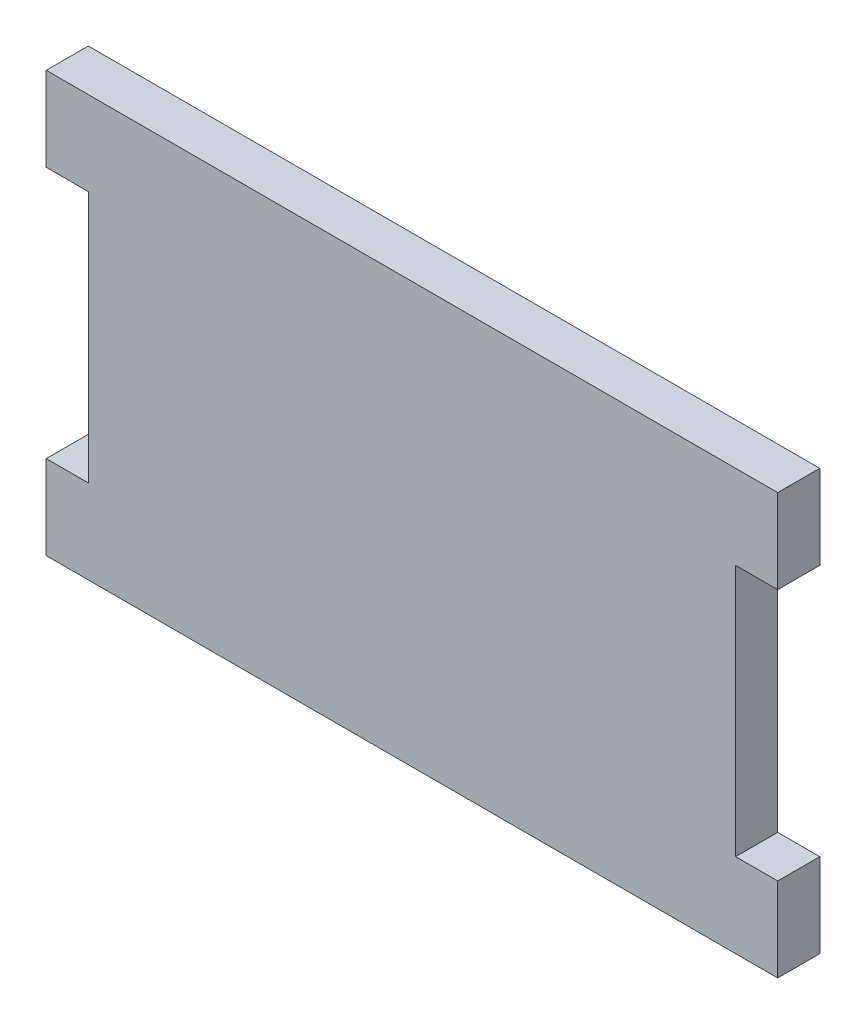
ISO-10303-21;
HEADER;
FILE_DESCRIPTION(('STEP AP214'),'2;1');
FILE_NAME('part.step','',(''),(''),'','','');
FILE_SCHEMA(('AUTOMOTIVE_DESIGN { 1 0 10303 214 1 1 1 1 }'));
ENDSEC;
DATA;
#1=APPLICATION_CONTEXT('core data for automotive mechanical design processes');
#2=APPLICATION_PROTOCOL_DEFINITION('international standard','automotive_design',2000,#1);
#3=PRODUCT_CONTEXT('',#1,'mechanical');
#4=PRODUCT('Part','Part','',(#3));
#5=PRODUCT_RELATED_PRODUCT_CATEGORY('part','',(#4));
#6=PRODUCT_DEFINITION_FORMATION('','',#4);
#7=PRODUCT_DEFINITION_CONTEXT('part definition',#1,'design');
#8=PRODUCT_DEFINITION('design','',#6,#7);
#9=PRODUCT_DEFINITION_SHAPE('','',#8);
#10=(LENGTH_UNIT() NAMED_UNIT(*) SI_UNIT(.MILLI.,.METRE.));
#11=(NAMED_UNIT(*) PLANE_ANGLE_UNIT() SI_UNIT($,.RADIAN.));
#12=(NAMED_UNIT(*) SI_UNIT($,.STERADIAN.) SOLID_ANGLE_UNIT());
#13=UNCERTAINTY_MEASURE_WITH_UNIT(LENGTH_MEASURE(1.E-05),#10,'distance_accuracy_value','');
#14=(GEOMETRIC_REPRESENTATION_CONTEXT(3) GLOBAL_UNCERTAINTY_ASSIGNED_CONTEXT((#13)) GLOBAL_UNIT_ASSIGNED_CONTEXT((#10,
#11,#12)) REPRESENTATION_CONTEXT('',''));
#15=CARTESIAN_POINT('',(0.,0.,0.));
#16=DIRECTION('',(0.,0.,1.));
#17=DIRECTION('',(1.,0.,0.));
#18=AXIS2_PLACEMENT_3D('',#15,#16,#17);
#19=CARTESIAN_POINT('',(-43.5,-25.,5.));
#20=DIRECTION('',(0.,1.,0.));
#21=DIRECTION('',(0.,0.,1.));
#22=AXIS2_PLACEMENT_3D('',#19,#20,#21);
#23=PLANE('',#22);
#24=DIRECTION('',(1.,0.,0.));
#25=VECTOR('',#24,1.);
#26=CARTESIAN_POINT('',(-43.5,-25.,0.));
#27=LINE('',#26,#25);
#28=CARTESIAN_POINT('',(-43.5,-25.,0.));
#29=VERTEX_POINT('',#28);
#30=CARTESIAN_POINT('',(43.5,-25.,0.));
#31=VERTEX_POINT('',#30);
#32=EDGE_CURVE('E153',#29,#31,#27,.T.);
#33=ORIENTED_EDGE('',*,*,#32,.T.);
#34=DIRECTION('',(0.,0.,-1.));
#35=VECTOR('',#34,1.);
#36=CARTESIAN_POINT('',(43.5,-25.,5.));
#37=LINE('',#36,#35);
#38=CARTESIAN_POINT('',(43.5,-25.,5.));
#39=VERTEX_POINT('',#38);
#40=EDGE_CURVE('E11',#39,#31,#37,.T.);
#41=ORIENTED_EDGE('',*,*,#40,.F.);
#42=DIRECTION('',(1.,0.,0.));
#43=VECTOR('',#42,1.);
#44=CARTESIAN_POINT('',(-43.5,-25.,5.));
#45=LINE('',#44,#43);
#46=CARTESIAN_POINT('',(-43.5,-25.,5.));
#47=VERTEX_POINT('',#46);
#48=EDGE_CURVE('E175',#47,#39,#45,.T.);
#49=ORIENTED_EDGE('',*,*,#48,.F.);
#50=DIRECTION('',(0.,0.,-1.));
#51=VECTOR('',#50,1.);
#52=CARTESIAN_POINT('',(-43.5,-25.,5.));
#53=LINE('',#52,#51);
#54=EDGE_CURVE('E149',#47,#29,#53,.T.);
#55=ORIENTED_EDGE('',*,*,#54,.T.);
#56=EDGE_LOOP('',(#33,#41,#49,#55));
#57=FACE_BOUND('',#56,.T.);
#58=ADVANCED_FACE('F33',(#57),#23,.F.);
#59=CARTESIAN_POINT('',(43.5,-15.,5.));
#60=DIRECTION('',(-1.,0.,0.));
#61=DIRECTION('',(0.,-1.,0.));
#62=AXIS2_PLACEMENT_3D('',#59,#60,#61);
#63=PLANE('',#62);
#64=DIRECTION('',(0.,1.,0.));
#65=VECTOR('',#64,1.);
#66=CARTESIAN_POINT('',(43.5,-15.,0.));
#67=LINE('',#66,#65);
#68=CARTESIAN_POINT('',(43.5,-15.,0.));
#69=VERTEX_POINT('',#68);
#70=EDGE_CURVE('E156',#31,#69,#67,.T.);
#71=ORIENTED_EDGE('',*,*,#70,.T.);
#72=DIRECTION('',(0.,0.,-1.));
#73=VECTOR('',#72,1.);
#74=CARTESIAN_POINT('',(43.5,-15.,5.));
#75=LINE('',#74,#73);
#76=CARTESIAN_POINT('',(43.5,-15.,5.));
#77=VERTEX_POINT('',#76);
#78=EDGE_CURVE('E41',#77,#69,#75,.T.);
#79=ORIENTED_EDGE('',*,*,#78,.F.);
#80=DIRECTION('',(0.,1.,0.));
#81=VECTOR('',#80,1.);
#82=CARTESIAN_POINT('',(43.5,-15.,5.));
#83=LINE('',#82,#81);
#84=EDGE_CURVE('E104',#39,#77,#83,.T.);
#85=ORIENTED_EDGE('',*,*,#84,.F.);
#86=ORIENTED_EDGE('',*,*,#40,.T.);
#87=EDGE_LOOP('',(#71,#79,#85,#86));
#88=FACE_BOUND('',#87,.T.);
#89=ADVANCED_FACE('F253',(#88),#63,.F.);
#90=CARTESIAN_POINT('',(43.5,-15.,5.));
#91=DIRECTION('',(0.,-1.,0.));
#92=DIRECTION('',(0.,0.,-1.));
#93=AXIS2_PLACEMENT_3D('',#90,#91,#92);
#94=PLANE('',#93);
#95=DIRECTION('',(-1.,0.,0.));
#96=VECTOR('',#95,1.);
#97=CARTESIAN_POINT('',(43.5,-15.,0.));
#98=LINE('',#97,#96);
#99=CARTESIAN_POINT('',(38.5,-15.,0.));
#100=VERTEX_POINT('',#99);
#101=EDGE_CURVE('E158',#69,#100,#98,.T.);
#102=ORIENTED_EDGE('',*,*,#101,.T.);
#103=DIRECTION('',(0.,0.,-1.));
#104=VECTOR('',#103,1.);
#105=CARTESIAN_POINT('',(38.5,-15.,5.));
#106=LINE('',#105,#104);
#107=CARTESIAN_POINT('',(38.5,-15.,5.));
#108=VERTEX_POINT('',#107);
#109=EDGE_CURVE('E194',#108,#100,#106,.T.);
#110=ORIENTED_EDGE('',*,*,#109,.F.);
#111=DIRECTION('',(-1.,0.,0.));
#112=VECTOR('',#111,1.);
#113=CARTESIAN_POINT('',(43.5,-15.,5.));
#114=LINE('',#113,#112);
#115=EDGE_CURVE('E202',#77,#108,#114,.T.);
#116=ORIENTED_EDGE('',*,*,#115,.F.);
#117=ORIENTED_EDGE('',*,*,#78,.T.);
#118=EDGE_LOOP('',(#102,#110,#116,#117));
#119=FACE_BOUND('',#118,.T.);
#120=ADVANCED_FACE('F200',(#119),#94,.F.);
#121=CARTESIAN_POINT('',(38.5,15.,5.));
#122=DIRECTION('',(-1.,0.,0.));
#123=DIRECTION('',(0.,-1.,0.));
#124=AXIS2_PLACEMENT_3D('',#121,#122,#123);
#125=PLANE('',#124);
#126=DIRECTION('',(0.,1.,0.));
#127=VECTOR('',#126,1.);
#128=CARTESIAN_POINT('',(38.5,15.,0.));
#129=LINE('',#128,#127);
#130=CARTESIAN_POINT('',(38.5,15.,0.));
#131=VERTEX_POINT('',#130);
#132=EDGE_CURVE('E160',#100,#131,#129,.T.);
#133=ORIENTED_EDGE('',*,*,#132,.T.);
#134=DIRECTION('',(0.,0.,-1.));
#135=VECTOR('',#134,1.);
#136=CARTESIAN_POINT('',(38.5,15.,5.));
#137=LINE('',#136,#135);
#138=CARTESIAN_POINT('',(38.5,15.,5.));
#139=VERTEX_POINT('',#138);
#140=EDGE_CURVE('E191',#139,#131,#137,.T.);
#141=ORIENTED_EDGE('',*,*,#140,.F.);
#142=DIRECTION('',(0.,1.,0.));
#143=VECTOR('',#142,1.);
#144=CARTESIAN_POINT('',(38.5,15.,5.));
#145=LINE('',#144,#143);
#146=EDGE_CURVE('E220',#108,#139,#145,.T.);
#147=ORIENTED_EDGE('',*,*,#146,.F.);
#148=ORIENTED_EDGE('',*,*,#109,.T.);
#149=EDGE_LOOP('',(#133,#141,#147,#148));
#150=FACE_BOUND('',#149,.T.);
#151=ADVANCED_FACE('F211',(#150),#125,.F.);
#152=CARTESIAN_POINT('',(43.5,15.,5.));
#153=DIRECTION('',(0.,1.,0.));
#154=DIRECTION('',(0.,0.,1.));
#155=AXIS2_PLACEMENT_3D('',#152,#153,#154);
#156=PLANE('',#155);
#157=DIRECTION('',(1.,0.,0.));
#158=VECTOR('',#157,1.);
#159=CARTESIAN_POINT('',(43.5,15.,0.));
#160=LINE('',#159,#158);
#161=CARTESIAN_POINT('',(43.5,15.,0.));
#162=VERTEX_POINT('',#161);
#163=EDGE_CURVE('E162',#131,#162,#160,.T.);
#164=ORIENTED_EDGE('',*,*,#163,.T.);
#165=DIRECTION('',(0.,0.,-1.));
#166=VECTOR('',#165,1.);
#167=CARTESIAN_POINT('',(43.5,15.,5.));
#168=LINE('',#167,#166);
#169=CARTESIAN_POINT('',(43.5,15.,5.));
#170=VERTEX_POINT('',#169);
#171=EDGE_CURVE('E188',#170,#162,#168,.T.);
#172=ORIENTED_EDGE('',*,*,#171,.F.);
#173=DIRECTION('',(1.,0.,0.));
#174=VECTOR('',#173,1.);
#175=CARTESIAN_POINT('',(43.5,15.,5.));
#176=LINE('',#175,#174);
#177=EDGE_CURVE('E217',#139,#170,#176,.T.);
#178=ORIENTED_EDGE('',*,*,#177,.F.);
#179=ORIENTED_EDGE('',*,*,#140,.T.);
#180=EDGE_LOOP('',(#164,#172,#178,#179));
#181=FACE_BOUND('',#180,.T.);
#182=ADVANCED_FACE('F215',(#181),#156,.F.);
#183=CARTESIAN_POINT('',(43.5,25.,5.));
#184=DIRECTION('',(-1.,0.,0.));
#185=DIRECTION('',(0.,0.,1.));
#186=AXIS2_PLACEMENT_3D('',#183,#184,#185);
#187=PLANE('',#186);
#188=DIRECTION('',(0.,1.,0.));
#189=VECTOR('',#188,1.);
#190=CARTESIAN_POINT('',(43.5,25.,0.));
#191=LINE('',#190,#189);
#192=CARTESIAN_POINT('',(43.5,25.,0.));
#193=VERTEX_POINT('',#192);
#194=EDGE_CURVE('E164',#162,#193,#191,.T.);
#195=ORIENTED_EDGE('',*,*,#194,.T.);
#196=DIRECTION('',(0.,0.,-1.));
#197=VECTOR('',#196,1.);
#198=CARTESIAN_POINT('',(43.5,25.,5.));
#199=LINE('',#198,#197);
#200=CARTESIAN_POINT('',(43.5,25.,5.));
#201=VERTEX_POINT('',#200);
#202=EDGE_CURVE('E185',#201,#193,#199,.T.);
#203=ORIENTED_EDGE('',*,*,#202,.F.);
#204=DIRECTION('',(0.,1.,0.));
#205=VECTOR('',#204,1.);
#206=CARTESIAN_POINT('',(43.5,25.,5.));
#207=LINE('',#206,#205);
#208=EDGE_CURVE('E219',#170,#201,#207,.T.);
#209=ORIENTED_EDGE('',*,*,#208,.F.);
#210=ORIENTED_EDGE('',*,*,#171,.T.);
#211=EDGE_LOOP('',(#195,#203,#209,#210));
#212=FACE_BOUND('',#211,.T.);
#213=ADVANCED_FACE('F266',(#212),#187,.F.);
#214=CARTESIAN_POINT('',(-43.5,25.,5.));
#215=DIRECTION('',(0.,-1.,0.));
#216=DIRECTION('',(0.,0.,-1.));
#217=AXIS2_PLACEMENT_3D('',#214,#215,#216);
#218=PLANE('',#217);
#219=DIRECTION('',(-1.,0.,0.));
#220=VECTOR('',#219,1.);
#221=CARTESIAN_POINT('',(-43.5,25.,0.));
#222=LINE('',#221,#220);
#223=CARTESIAN_POINT('',(-43.5,25.,0.));
#224=VERTEX_POINT('',#223);
#225=EDGE_CURVE('E166',#193,#224,#222,.T.);
#226=ORIENTED_EDGE('',*,*,#225,.T.);
#227=DIRECTION('',(0.,0.,-1.));
#228=VECTOR('',#227,1.);
#229=CARTESIAN_POINT('',(-43.5,25.,5.));
#230=LINE('',#229,#228);
#231=CARTESIAN_POINT('',(-43.5,25.,5.));
#232=VERTEX_POINT('',#231);
#233=EDGE_CURVE('E182',#232,#224,#230,.T.);
#234=ORIENTED_EDGE('',*,*,#233,.F.);
#235=DIRECTION('',(-1.,0.,0.));
#236=VECTOR('',#235,1.);
#237=CARTESIAN_POINT('',(-43.5,25.,5.));
#238=LINE('',#237,#236);
#239=EDGE_CURVE('E222',#201,#232,#238,.T.);
#240=ORIENTED_EDGE('',*,*,#239,.F.);
#241=ORIENTED_EDGE('',*,*,#202,.T.);
#242=EDGE_LOOP('',(#226,#234,#240,#241));
#243=FACE_BOUND('',#242,.T.);
#244=ADVANCED_FACE('F269',(#243),#218,.F.);
#245=CARTESIAN_POINT('',(-43.5,25.,5.));
#246=DIRECTION('',(1.,0.,0.));
#247=DIRECTION('',(0.,0.,-1.));
#248=AXIS2_PLACEMENT_3D('',#245,#246,#247);
#249=PLANE('',#248);
#250=DIRECTION('',(0.,-1.,0.));
#251=VECTOR('',#250,1.);
#252=CARTESIAN_POINT('',(-43.5,25.,0.));
#253=LINE('',#252,#251);
#254=CARTESIAN_POINT('',(-43.5,15.,0.));
#255=VERTEX_POINT('',#254);
#256=EDGE_CURVE('E168',#224,#255,#253,.T.);
#257=ORIENTED_EDGE('',*,*,#256,.T.);
#258=DIRECTION('',(0.,0.,-1.));
#259=VECTOR('',#258,1.);
#260=CARTESIAN_POINT('',(-43.5,15.,5.));
#261=LINE('',#260,#259);
#262=CARTESIAN_POINT('',(-43.5,15.,5.));
#263=VERTEX_POINT('',#262);
#264=EDGE_CURVE('E179',#263,#255,#261,.T.);
#265=ORIENTED_EDGE('',*,*,#264,.F.);
#266=DIRECTION('',(0.,-1.,0.));
#267=VECTOR('',#266,1.);
#268=CARTESIAN_POINT('',(-43.5,25.,5.));
#269=LINE('',#268,#267);
#270=EDGE_CURVE('E228',#232,#263,#269,.T.);
#271=ORIENTED_EDGE('',*,*,#270,.F.);
#272=ORIENTED_EDGE('',*,*,#233,.T.);
#273=EDGE_LOOP('',(#257,#265,#271,#272));
#274=FACE_BOUND('',#273,.T.);
#275=ADVANCED_FACE('F234',(#274),#249,.F.);
#276=CARTESIAN_POINT('',(-43.5,15.,5.));
#277=DIRECTION('',(0.,1.,0.));
#278=DIRECTION('',(-1.,0.,0.));
#279=AXIS2_PLACEMENT_3D('',#276,#277,#278);
#280=PLANE('',#279);
#281=DIRECTION('',(1.,0.,0.));
#282=VECTOR('',#281,1.);
#283=CARTESIAN_POINT('',(-43.5,15.,0.));
#284=LINE('',#283,#282);
#285=CARTESIAN_POINT('',(-38.5,15.,0.));
#286=VERTEX_POINT('',#285);
#287=EDGE_CURVE('E170',#255,#286,#284,.T.);
#288=ORIENTED_EDGE('',*,*,#287,.T.);
#289=DIRECTION('',(0.,0.,-1.));
#290=VECTOR('',#289,1.);
#291=CARTESIAN_POINT('',(-38.5,15.,5.));
#292=LINE('',#291,#290);
#293=CARTESIAN_POINT('',(-38.5,15.,5.));
#294=VERTEX_POINT('',#293);
#295=EDGE_CURVE('E144',#294,#286,#292,.T.);
#296=ORIENTED_EDGE('',*,*,#295,.F.);
#297=DIRECTION('',(1.,0.,0.));
#298=VECTOR('',#297,1.);
#299=CARTESIAN_POINT('',(-43.5,15.,5.));
#300=LINE('',#299,#298);
#301=EDGE_CURVE('E135',#263,#294,#300,.T.);
#302=ORIENTED_EDGE('',*,*,#301,.F.);
#303=ORIENTED_EDGE('',*,*,#264,.T.);
#304=EDGE_LOOP('',(#288,#296,#302,#303));
#305=FACE_BOUND('',#304,.T.);
#306=ADVANCED_FACE('F238',(#305),#280,.F.);
#307=CARTESIAN_POINT('',(-38.5,15.,5.));
#308=DIRECTION('',(1.,0.,0.));
#309=DIRECTION('',(0.,1.,0.));
#310=AXIS2_PLACEMENT_3D('',#307,#308,#309);
#311=PLANE('',#310);
#312=DIRECTION('',(0.,-1.,0.));
#313=VECTOR('',#312,1.);
#314=CARTESIAN_POINT('',(-38.5,15.,0.));
#315=LINE('',#314,#313);
#316=CARTESIAN_POINT('',(-38.5,-15.,0.));
#317=VERTEX_POINT('',#316);
#318=EDGE_CURVE('E143',#286,#317,#315,.T.);
#319=ORIENTED_EDGE('',*,*,#318,.T.);
#320=DIRECTION('',(0.,0.,-1.));
#321=VECTOR('',#320,1.);
#322=CARTESIAN_POINT('',(-38.5,-15.,5.));
#323=LINE('',#322,#321);
#324=CARTESIAN_POINT('',(-38.5,-15.,5.));
#325=VERTEX_POINT('',#324);
#326=EDGE_CURVE('E140',#325,#317,#323,.T.);
#327=ORIENTED_EDGE('',*,*,#326,.F.);
#328=DIRECTION('',(0.,-1.,0.));
#329=VECTOR('',#328,1.);
#330=CARTESIAN_POINT('',(-38.5,15.,5.));
#331=LINE('',#330,#329);
#332=EDGE_CURVE('E129',#294,#325,#331,.T.);
#333=ORIENTED_EDGE('',*,*,#332,.F.);
#334=ORIENTED_EDGE('',*,*,#295,.T.);
#335=EDGE_LOOP('',(#319,#327,#333,#334));
#336=FACE_BOUND('',#335,.T.);
#337=ADVANCED_FACE('F141',(#336),#311,.F.);
#338=CARTESIAN_POINT('',(-43.5,-15.,5.));
#339=DIRECTION('',(0.,-1.,0.));
#340=DIRECTION('',(1.,0.,0.));
#341=AXIS2_PLACEMENT_3D('',#338,#339,#340);
#342=PLANE('',#341);
#343=DIRECTION('',(-1.,0.,0.));
#344=VECTOR('',#343,1.);
#345=CARTESIAN_POINT('',(-43.5,-15.,0.));
#346=LINE('',#345,#344);
#347=CARTESIAN_POINT('',(-43.5,-15.,0.));
#348=VERTEX_POINT('',#347);
#349=EDGE_CURVE('E90',#317,#348,#346,.T.);
#350=ORIENTED_EDGE('',*,*,#349,.T.);
#351=DIRECTION('',(0.,0.,-1.));
#352=VECTOR('',#351,1.);
#353=CARTESIAN_POINT('',(-43.5,-15.,5.));
#354=LINE('',#353,#352);
#355=CARTESIAN_POINT('',(-43.5,-15.,5.));
#356=VERTEX_POINT('',#355);
#357=EDGE_CURVE('E145',#356,#348,#354,.T.);
#358=ORIENTED_EDGE('',*,*,#357,.F.);
#359=DIRECTION('',(-1.,0.,0.));
#360=VECTOR('',#359,1.);
#361=CARTESIAN_POINT('',(-43.5,-15.,5.));
#362=LINE('',#361,#360);
#363=EDGE_CURVE('E133',#325,#356,#362,.T.);
#364=ORIENTED_EDGE('',*,*,#363,.F.);
#365=ORIENTED_EDGE('',*,*,#326,.T.);
#366=EDGE_LOOP('',(#350,#358,#364,#365));
#367=FACE_BOUND('',#366,.T.);
#368=ADVANCED_FACE('F147',(#367),#342,.F.);
#369=CARTESIAN_POINT('',(-43.5,-15.,5.));
#370=DIRECTION('',(1.,0.,0.));
#371=DIRECTION('',(0.,0.,-1.));
#372=AXIS2_PLACEMENT_3D('',#369,#370,#371);
#373=PLANE('',#372);
#374=DIRECTION('',(0.,-1.,0.));
#375=VECTOR('',#374,1.);
#376=CARTESIAN_POINT('',(-43.5,-15.,0.));
#377=LINE('',#376,#375);
#378=EDGE_CURVE('E96',#348,#29,#377,.T.);
#379=ORIENTED_EDGE('',*,*,#378,.T.);
#380=ORIENTED_EDGE('',*,*,#54,.F.);
#381=DIRECTION('',(0.,-1.,0.));
#382=VECTOR('',#381,1.);
#383=CARTESIAN_POINT('',(-43.5,-15.,5.));
#384=LINE('',#383,#382);
#385=EDGE_CURVE('E49',#356,#47,#384,.T.);
#386=ORIENTED_EDGE('',*,*,#385,.F.);
#387=ORIENTED_EDGE('',*,*,#357,.T.);
#388=EDGE_LOOP('',(#379,#380,#386,#387));
#389=FACE_BOUND('',#388,.T.);
#390=ADVANCED_FACE('F242',(#389),#373,.F.);
#391=CARTESIAN_POINT('',(0.,0.,5.));
#392=DIRECTION('',(0.,0.,-1.));
#393=DIRECTION('',(-1.,0.,0.));
#394=AXIS2_PLACEMENT_3D('',#391,#392,#393);
#395=PLANE('',#394);
#396=ORIENTED_EDGE('',*,*,#48,.T.);
#397=ORIENTED_EDGE('',*,*,#84,.T.);
#398=ORIENTED_EDGE('',*,*,#115,.T.);
#399=ORIENTED_EDGE('',*,*,#146,.T.);
#400=ORIENTED_EDGE('',*,*,#177,.T.);
#401=ORIENTED_EDGE('',*,*,#208,.T.);
#402=ORIENTED_EDGE('',*,*,#239,.T.);
#403=ORIENTED_EDGE('',*,*,#270,.T.);
#404=ORIENTED_EDGE('',*,*,#301,.T.);
#405=ORIENTED_EDGE('',*,*,#332,.T.);
#406=ORIENTED_EDGE('',*,*,#363,.T.);
#407=ORIENTED_EDGE('',*,*,#385,.T.);
#408=EDGE_LOOP('',(#396,#397,#398,#399,#400,#401,#402,#403,#404,#405,#406,#407));
#409=FACE_BOUND('',#408,.T.);
#410=ADVANCED_FACE('F131',(#409),#395,.F.);
#411=CARTESIAN_POINT('',(0.,0.,0.));
#412=DIRECTION('',(0.,0.,-1.));
#413=DIRECTION('',(-1.,0.,0.));
#414=AXIS2_PLACEMENT_3D('',#411,#412,#413);
#415=PLANE('',#414);
#416=ORIENTED_EDGE('',*,*,#32,.F.);
#417=ORIENTED_EDGE('',*,*,#378,.F.);
#418=ORIENTED_EDGE('',*,*,#349,.F.);
#419=ORIENTED_EDGE('',*,*,#318,.F.);
#420=ORIENTED_EDGE('',*,*,#287,.F.);
#421=ORIENTED_EDGE('',*,*,#256,.F.);
#422=ORIENTED_EDGE('',*,*,#225,.F.);
#423=ORIENTED_EDGE('',*,*,#194,.F.);
#424=ORIENTED_EDGE('',*,*,#163,.F.);
#425=ORIENTED_EDGE('',*,*,#132,.F.);
#426=ORIENTED_EDGE('',*,*,#101,.F.);
#427=ORIENTED_EDGE('',*,*,#70,.F.);
#428=EDGE_LOOP('',(#416,#417,#418,#419,#420,#421,#422,#423,#424,#425,#426,#427));
#429=FACE_BOUND('',#428,.T.);
#430=ADVANCED_FACE('F206',(#429),#415,.T.);
#431=CLOSED_SHELL('',(#58,#89,#120,#151,#182,#213,#244,#275,#306,#337,#368,#390,#410,#430));
#432=MANIFOLD_SOLID_BREP('B2',#431);
#433=ADVANCED_BREP_SHAPE_REPRESENTATION('',(#18,#432),#14);
#434=SHAPE_DEFINITION_REPRESENTATION(#9,#433);
ENDSEC;
END-ISO-10303-21;
